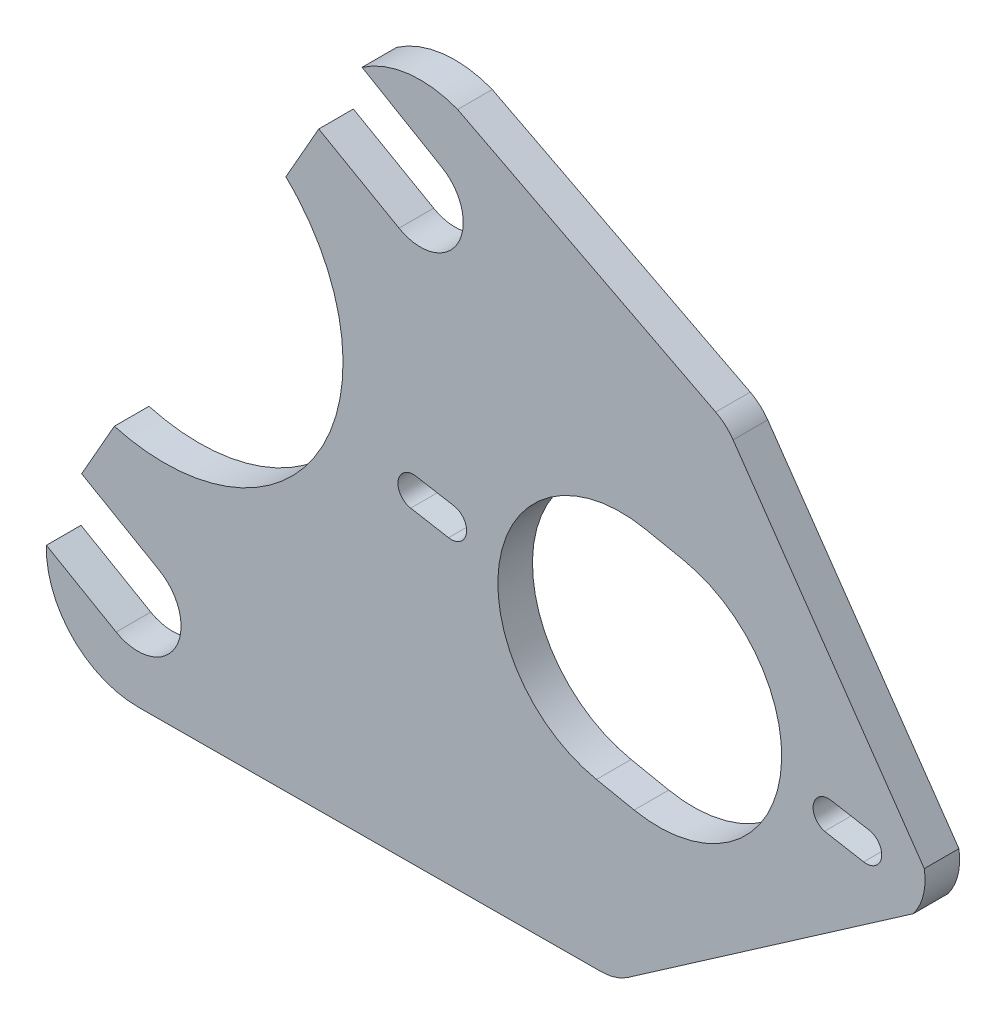
ISO-10303-21;
HEADER;
FILE_DESCRIPTION(('STEP AP214'),'2;1');
FILE_NAME('part.step','',(''),(''),'','','');
FILE_SCHEMA(('AUTOMOTIVE_DESIGN { 1 0 10303 214 1 1 1 1 }'));
ENDSEC;
DATA;
#1=APPLICATION_CONTEXT('core data for automotive mechanical design processes');
#2=APPLICATION_PROTOCOL_DEFINITION('international standard','automotive_design',2000,#1);
#3=PRODUCT_CONTEXT('',#1,'mechanical');
#4=PRODUCT('Part','Part','',(#3));
#5=PRODUCT_RELATED_PRODUCT_CATEGORY('part','',(#4));
#6=PRODUCT_DEFINITION_FORMATION('','',#4);
#7=PRODUCT_DEFINITION_CONTEXT('part definition',#1,'design');
#8=PRODUCT_DEFINITION('design','',#6,#7);
#9=PRODUCT_DEFINITION_SHAPE('','',#8);
#10=(LENGTH_UNIT() NAMED_UNIT(*) SI_UNIT(.MILLI.,.METRE.));
#11=(NAMED_UNIT(*) PLANE_ANGLE_UNIT() SI_UNIT($,.RADIAN.));
#12=(NAMED_UNIT(*) SI_UNIT($,.STERADIAN.) SOLID_ANGLE_UNIT());
#13=UNCERTAINTY_MEASURE_WITH_UNIT(LENGTH_MEASURE(1.E-05),#10,'distance_accuracy_value','');
#14=(GEOMETRIC_REPRESENTATION_CONTEXT(3) GLOBAL_UNCERTAINTY_ASSIGNED_CONTEXT((#13)) GLOBAL_UNIT_ASSIGNED_CONTEXT((#10,
#11,#12)) REPRESENTATION_CONTEXT('',''));
#15=CARTESIAN_POINT('',(0.,0.,0.));
#16=DIRECTION('',(0.,0.,1.));
#17=DIRECTION('',(1.,0.,0.));
#18=AXIS2_PLACEMENT_3D('',#15,#16,#17);
#19=CARTESIAN_POINT('',(62.0385147546457,77.7176448762416,3.6));
#20=DIRECTION('',(0.,0.,1.));
#21=DIRECTION('',(1.,0.,0.));
#22=AXIS2_PLACEMENT_3D('',#19,#20,#21);
#23=PLANE('',#22);
#24=CARTESIAN_POINT('',(88.3938452046275,69.2605225420493,3.6));
#25=DIRECTION('',(0.,0.,1.));
#26=DIRECTION('',(1.,0.,0.));
#27=AXIS2_PLACEMENT_3D('',#24,#25,#26);
#28=CIRCLE('',#27,1.59999999999999);
#29=CARTESIAN_POINT('',(88.6716822936606,70.8362149460285,3.6));
#30=VERTEX_POINT('',#29);
#31=CARTESIAN_POINT('',(88.1160081155944,67.6848301380701,3.6));
#32=VERTEX_POINT('',#31);
#33=EDGE_CURVE('E451',#30,#32,#28,.T.);
#34=ORIENTED_EDGE('',*,*,#33,.F.);
#35=DIRECTION('',(-0.984807752486969,0.173648180645712,0.));
#36=VECTOR('',#35,1.);
#37=CARTESIAN_POINT('',(14.7874848721337,83.8639926298628,3.6));
#38=LINE('',#37,#36);
#39=CARTESIAN_POINT('',(92.6109133036085,70.1416222234456,3.6));
#40=VERTEX_POINT('',#39);
#41=EDGE_CURVE('E449',#40,#30,#38,.T.);
#42=ORIENTED_EDGE('',*,*,#41,.F.);
#43=CARTESIAN_POINT('',(92.3330762145753,68.5659298194664,3.6));
#44=DIRECTION('',(0.,0.,1.));
#45=DIRECTION('',(1.,0.,0.));
#46=AXIS2_PLACEMENT_3D('',#43,#44,#45);
#47=CIRCLE('',#46,1.60000000000001);
#48=CARTESIAN_POINT('',(92.0552391255422,66.9902374154873,3.6));
#49=VERTEX_POINT('',#48);
#50=EDGE_CURVE('E457',#49,#40,#47,.T.);
#51=ORIENTED_EDGE('',*,*,#50,.F.);
#52=DIRECTION('',(-0.98480775248697,0.173648180645706,0.));
#53=VECTOR('',#52,1.);
#54=CARTESIAN_POINT('',(14.2318106940669,80.7126078219041,3.6));
#55=LINE('',#54,#53);
#56=EDGE_CURVE('E454',#49,#32,#55,.T.);
#57=ORIENTED_EDGE('',*,*,#56,.T.);
#58=EDGE_LOOP('',(#34,#42,#51,#57));
#59=FACE_BOUND('',#58,.T.);
#60=DIRECTION('',(-0.98457738784415,0.174949613734897,0.));
#61=VECTOR('',#60,1.);
#62=CARTESIAN_POINT('',(14.3668853296237,80.8536248084082,3.6));
#63=LINE('',#62,#61);
#64=CARTESIAN_POINT('',(135.228884267393,59.377649135547,3.6));
#65=VERTEX_POINT('',#64);
#66=CARTESIAN_POINT('',(131.161569827429,60.1003704766984,3.6));
#67=VERTEX_POINT('',#66);
#68=EDGE_CURVE('E480',#65,#67,#63,.T.);
#69=ORIENTED_EDGE('',*,*,#68,.T.);
#70=CARTESIAN_POINT('',(131.569557431556,61.6474794304822,3.6));
#71=DIRECTION('',(0.,0.,1.));
#72=DIRECTION('',(1.,0.,0.));
#73=AXIS2_PLACEMENT_3D('',#70,#71,#72);
#74=CIRCLE('',#73,1.6);
#75=CARTESIAN_POINT('',(131.847360571655,63.2231778201976,3.6));
#76=VERTEX_POINT('',#75);
#77=EDGE_CURVE('E489',#76,#67,#74,.T.);
#78=ORIENTED_EDGE('',*,*,#77,.F.);
#79=DIRECTION('',(-0.98481149357211,0.173626962561322,0.));
#80=VECTOR('',#79,1.);
#81=CARTESIAN_POINT('',(14.7852333251543,83.86178908483,3.6));
#82=LINE('',#81,#80);
#83=CARTESIAN_POINT('',(135.786606545943,62.5286699699523,3.6));
#84=VERTEX_POINT('',#83);
#85=EDGE_CURVE('E486',#84,#76,#82,.T.);
#86=ORIENTED_EDGE('',*,*,#85,.F.);
#87=CARTESIAN_POINT('',(135.508803527145,60.952972268249,3.6));
#88=DIRECTION('',(0.,0.,1.));
#89=DIRECTION('',(1.,0.,0.));
#90=AXIS2_PLACEMENT_3D('',#87,#88,#89);
#91=CIRCLE('',#90,1.59999930137684);
#92=EDGE_CURVE('E483',#65,#84,#91,.T.);
#93=ORIENTED_EDGE('',*,*,#92,.F.);
#94=EDGE_LOOP('',(#69,#78,#86,#93));
#95=FACE_BOUND('',#94,.T.);
#96=CARTESIAN_POINT('',(109.981701342205,65.4540011230173,3.6));
#97=DIRECTION('',(0.,0.,1.));
#98=DIRECTION('',(1.,0.,0.));
#99=AXIS2_PLACEMENT_3D('',#96,#97,#98);
#100=CIRCLE('',#99,12.8);
#101=CARTESIAN_POINT('',(112.523140625589,77.9991629939887,3.6));
#102=VERTEX_POINT('',#101);
#103=CARTESIAN_POINT('',(107.440262058821,52.908839252046,3.6));
#104=VERTEX_POINT('',#103);
#105=EDGE_CURVE('E512',#102,#104,#100,.T.);
#106=ORIENTED_EDGE('',*,*,#105,.F.);
#107=DIRECTION('',(-0.980090771169636,0.198549944014369,0.));
#108=VECTOR('',#107,1.);
#109=CARTESIAN_POINT('',(19.6142968870189,96.8209356964479,3.6));
#110=LINE('',#109,#108);
#111=CARTESIAN_POINT('',(116.443503710267,77.2049632179312,3.6));
#112=VERTEX_POINT('',#111);
#113=EDGE_CURVE('E510',#112,#102,#110,.T.);
#114=ORIENTED_EDGE('',*,*,#113,.F.);
#115=CARTESIAN_POINT('',(113.902064426883,64.6598013469599,3.6));
#116=DIRECTION('',(0.,0.,1.));
#117=DIRECTION('',(1.,0.,0.));
#118=AXIS2_PLACEMENT_3D('',#115,#116,#117);
#119=CIRCLE('',#118,12.8);
#120=CARTESIAN_POINT('',(111.3606251435,52.1146394759885,3.6));
#121=VERTEX_POINT('',#120);
#122=EDGE_CURVE('E518',#121,#112,#119,.T.);
#123=ORIENTED_EDGE('',*,*,#122,.F.);
#124=DIRECTION('',(-0.980090771169636,0.198549944014369,0.));
#125=VECTOR('',#124,1.);
#126=CARTESIAN_POINT('',(14.5314183202511,71.7306119545052,3.6));
#127=LINE('',#126,#125);
#128=EDGE_CURVE('E515',#121,#104,#127,.T.);
#129=ORIENTED_EDGE('',*,*,#128,.T.);
#130=EDGE_LOOP('',(#106,#114,#123,#129));
#131=FACE_BOUND('',#130,.T.);
#132=DIRECTION('',(-0.821795837048083,-0.569782065539484,0.));
#133=VECTOR('',#132,1.);
#134=CARTESIAN_POINT('',(97.0414458836371,27.2329686710503,3.6));
#135=LINE('',#134,#133);
#136=CARTESIAN_POINT('',(140.392023866923,57.2895602867628,3.6));
#137=VERTEX_POINT('',#136);
#138=CARTESIAN_POINT('',(110.735316218971,36.7274457335327,3.6));
#139=VERTEX_POINT('',#138);
#140=EDGE_CURVE('E440',#137,#139,#135,.T.);
#141=ORIENTED_EDGE('',*,*,#140,.F.);
#142=CARTESIAN_POINT('',(135.508803527145,60.952972268249,3.6));
#143=DIRECTION('',(0.,0.,1.));
#144=DIRECTION('',(1.,0.,0.));
#145=AXIS2_PLACEMENT_3D('',#142,#143,#144);
#146=CIRCLE('',#145,6.10462351279076);
#147=CARTESIAN_POINT('',(141.535727347608,61.9238571714403,3.6));
#148=VERTEX_POINT('',#147);
#149=EDGE_CURVE('E422',#137,#148,#146,.T.);
#150=ORIENTED_EDGE('',*,*,#149,.T.);
#151=DIRECTION('',(0.569782065539484,-0.821795837048083,0.));
#152=VECTOR('',#151,1.);
#153=CARTESIAN_POINT('',(124.581434059325,86.3770095029575,3.6));
#154=LINE('',#153,#152);
#155=CARTESIAN_POINT('',(121.651882961464,90.6022967526749,3.6));
#156=VERTEX_POINT('',#155);
#157=EDGE_CURVE('E426',#156,#148,#154,.T.);
#158=ORIENTED_EDGE('',*,*,#157,.F.);
#159=CARTESIAN_POINT('',(117.542903776224,87.7533864249775,3.6));
#160=DIRECTION('',(0.,0.,1.));
#161=DIRECTION('',(1.,0.,0.));
#162=AXIS2_PLACEMENT_3D('',#159,#160,#161);
#163=CIRCLE('',#162,5.);
#164=CARTESIAN_POINT('',(119.834613545866,92.1972660736322,3.6));
#165=VERTEX_POINT('',#164);
#166=EDGE_CURVE('E711',#156,#165,#163,.T.);
#167=ORIENTED_EDGE('',*,*,#166,.T.);
#168=DIRECTION('',(-0.888775929730931,0.458341953928417,0.));
#169=VECTOR('',#168,1.);
#170=CARTESIAN_POINT('',(62.7323198720739,121.64493221842,3.6));
#171=LINE('',#170,#169);
#172=CARTESIAN_POINT('',(92.9994998125568,106.0361404749,3.6));
#173=VERTEX_POINT('',#172);
#174=EDGE_CURVE('E447',#165,#173,#171,.T.);
#175=ORIENTED_EDGE('',*,*,#174,.T.);
#176=CARTESIAN_POINT('',(89.1295998537948,96.1540237001324,3.6));
#177=DIRECTION('',(0.,0.,1.));
#178=DIRECTION('',(1.,0.,0.));
#179=AXIS2_PLACEMENT_3D('',#176,#177,#178);
#180=CIRCLE('',#179,10.6128392827256);
#181=CARTESIAN_POINT('',(83.0608323656568,104.8604821544,3.6));
#182=VERTEX_POINT('',#181);
#183=EDGE_CURVE('E696',#173,#182,#180,.T.);
#184=ORIENTED_EDGE('',*,*,#183,.T.);
#185=DIRECTION('',(0.863225442370652,-0.504818616578263,0.));
#186=VECTOR('',#185,1.);
#187=CARTESIAN_POINT('',(83.0608323656568,104.8604821544,3.6));
#188=LINE('',#187,#186);
#189=CARTESIAN_POINT('',(91.3561306915568,100.0093496235,3.6));
#190=VERTEX_POINT('',#189);
#191=EDGE_CURVE('E723',#182,#190,#188,.T.);
#192=ORIENTED_EDGE('',*,*,#191,.T.);
#193=CARTESIAN_POINT('',(89.1300439095068,96.1537673169998,3.6));
#194=DIRECTION('',(0.,0.,1.));
#195=DIRECTION('',(1.,0.,0.));
#196=AXIS2_PLACEMENT_3D('',#193,#194,#195);
#197=CIRCLE('',#196,4.45207561519496);
#198=CARTESIAN_POINT('',(86.9039571274568,92.2981850104998,3.6));
#199=VERTEX_POINT('',#198);
#200=EDGE_CURVE('E725',#199,#190,#197,.T.);
#201=ORIENTED_EDGE('',*,*,#200,.F.);
#202=DIRECTION('',(0.868810396856309,-0.495144922537214,0.));
#203=VECTOR('',#202,1.);
#204=CARTESIAN_POINT('',(78.5551802845568,97.0562478491998,3.6));
#205=LINE('',#204,#203);
#206=CARTESIAN_POINT('',(78.5551802845568,97.0562478491998,3.6));
#207=VERTEX_POINT('',#206);
#208=EDGE_CURVE('E748',#207,#199,#205,.T.);
#209=ORIENTED_EDGE('',*,*,#208,.F.);
#210=DIRECTION('',(0.494117617130238,0.869395065802386,0.));
#211=VECTOR('',#210,1.);
#212=CARTESIAN_POINT('',(75.1349810422863,91.0384410716137,3.6));
#213=LINE('',#212,#211);
#214=CARTESIAN_POINT('',(75.1349810422863,91.0384410716137,3.6));
#215=VERTEX_POINT('',#214);
#216=EDGE_CURVE('E564',#215,#207,#213,.T.);
#217=ORIENTED_EDGE('',*,*,#216,.F.);
#218=CARTESIAN_POINT('',(62.0385147546457,77.7176448762416,3.6));
#219=DIRECTION('',(0.,0.,1.));
#220=DIRECTION('',(0.869395065803295,-0.494117617128639,0.));
#221=AXIS2_PLACEMENT_3D('',#218,#219,#220);
#222=ELLIPSE('',#221,19.1691381710503,18.6472955858899);
#223=CARTESIAN_POINT('',(57.2951320903117,59.6494030856947,3.6));
#224=VERTEX_POINT('',#223);
#225=EDGE_CURVE('E560',#224,#215,#222,.T.);
#226=ORIENTED_EDGE('',*,*,#225,.F.);
#227=DIRECTION('',(0.494117617130272,0.869395065802367,0.));
#228=VECTOR('',#227,1.);
#229=CARTESIAN_POINT('',(53.8970007932,53.6704246396,3.6));
#230=LINE('',#229,#228);
#231=CARTESIAN_POINT('',(53.8970007932,53.6704246396,3.6));
#232=VERTEX_POINT('',#231);
#233=EDGE_CURVE('E557',#232,#224,#230,.T.);
#234=ORIENTED_EDGE('',*,*,#233,.F.);
#235=DIRECTION('',(-0.865993027095381,0.500056073877899,0.));
#236=VECTOR('',#235,1.);
#237=CARTESIAN_POINT('',(61.9848103957,49.0002273175,3.6));
#238=LINE('',#237,#236);
#239=CARTESIAN_POINT('',(61.9848103957,49.0002273175,3.6));
#240=VERTEX_POINT('',#239);
#241=EDGE_CURVE('E554',#240,#232,#238,.T.);
#242=ORIENTED_EDGE('',*,*,#241,.F.);
#243=CARTESIAN_POINT('',(59.73290559445,45.10432597855,3.6));
#244=DIRECTION('',(0.,0.,1.));
#245=DIRECTION('',(1.,0.,0.));
#246=AXIS2_PLACEMENT_3D('',#243,#244,#245);
#247=CIRCLE('',#246,4.49990249635758);
#248=CARTESIAN_POINT('',(57.4810007932,41.2084246396,3.6));
#249=VERTEX_POINT('',#248);
#250=EDGE_CURVE('E551',#249,#240,#247,.T.);
#251=ORIENTED_EDGE('',*,*,#250,.F.);
#252=DIRECTION('',(0.866028909405279,-0.499993928037435,0.));
#253=VECTOR('',#252,1.);
#254=CARTESIAN_POINT('',(50.2285358717,45.3955694158,3.6));
#255=LINE('',#254,#253);
#256=CARTESIAN_POINT('',(50.2285358717,45.3955694158,3.6));
#257=VERTEX_POINT('',#256);
#258=EDGE_CURVE('E548',#257,#249,#255,.T.);
#259=ORIENTED_EDGE('',*,*,#258,.F.);
#260=CARTESIAN_POINT('',(59.7347823866165,45.103647176955,3.6));
#261=DIRECTION('',(0.,0.,1.));
#262=DIRECTION('',(1.,0.,0.));
#263=AXIS2_PLACEMENT_3D('',#260,#261,#262);
#264=CIRCLE('',#263,9.51072770064907);
#265=CARTESIAN_POINT('',(59.7828894487,35.5930411444,3.6));
#266=VERTEX_POINT('',#265);
#267=EDGE_CURVE('E544',#257,#266,#264,.T.);
#268=ORIENTED_EDGE('',*,*,#267,.T.);
#269=DIRECTION('',(0.999987207278143,0.00505818940525294,0.));
#270=VECTOR('',#269,1.);
#271=CARTESIAN_POINT('',(107.879099237603,35.8363239954365,3.6));
#272=LINE('',#271,#270);
#273=CARTESIAN_POINT('',(107.9116968383,35.8364888823843,3.6));
#274=VERTEX_POINT('',#273);
#275=EDGE_CURVE('E541',#266,#274,#272,.T.);
#276=ORIENTED_EDGE('',*,*,#275,.T.);
#277=CARTESIAN_POINT('',(107.886405891274,40.8364249187731,3.6));
#278=DIRECTION('',(0.,0.,1.));
#279=DIRECTION('',(1.,0.,0.));
#280=AXIS2_PLACEMENT_3D('',#277,#278,#279);
#281=CIRCLE('',#280,5.);
#282=EDGE_CURVE('E761',#274,#139,#281,.T.);
#283=ORIENTED_EDGE('',*,*,#282,.T.);
#284=EDGE_LOOP('',(#141,#150,#158,#167,#175,#184,#192,#201,#209,#217,#226,#234,#242,#251,#259,
#268,#276,#283));
#285=FACE_BOUND('',#284,.T.);
#286=ADVANCED_FACE('F224',(#59,#95,#131,#285),#23,.T.);
#287=CARTESIAN_POINT('',(62.0385147546457,77.7176448762416,0.));
#288=DIRECTION('',(0.,0.,1.));
#289=DIRECTION('',(1.,0.,0.));
#290=AXIS2_PLACEMENT_3D('',#287,#288,#289);
#291=PLANE('',#290);
#292=DIRECTION('',(-0.984807752486969,0.173648180645712,0.));
#293=VECTOR('',#292,1.);
#294=CARTESIAN_POINT('',(14.7874848721337,83.8639926298628,0.));
#295=LINE('',#294,#293);
#296=CARTESIAN_POINT('',(92.6109133036085,70.1416222234456,0.));
#297=VERTEX_POINT('',#296);
#298=CARTESIAN_POINT('',(88.6716822936606,70.8362149460285,0.));
#299=VERTEX_POINT('',#298);
#300=EDGE_CURVE('E443',#297,#299,#295,.T.);
#301=ORIENTED_EDGE('',*,*,#300,.T.);
#302=CARTESIAN_POINT('',(88.3938452046275,69.2605225420493,0.));
#303=DIRECTION('',(0.,0.,1.));
#304=DIRECTION('',(1.,0.,0.));
#305=AXIS2_PLACEMENT_3D('',#302,#303,#304);
#306=CIRCLE('',#305,1.59999999999999);
#307=CARTESIAN_POINT('',(88.1160081155944,67.6848301380701,0.));
#308=VERTEX_POINT('',#307);
#309=EDGE_CURVE('E462',#299,#308,#306,.T.);
#310=ORIENTED_EDGE('',*,*,#309,.T.);
#311=DIRECTION('',(-0.98480775248697,0.173648180645706,0.));
#312=VECTOR('',#311,1.);
#313=CARTESIAN_POINT('',(14.2318106940669,80.7126078219041,0.));
#314=LINE('',#313,#312);
#315=CARTESIAN_POINT('',(92.0552391255422,66.9902374154873,0.));
#316=VERTEX_POINT('',#315);
#317=EDGE_CURVE('E465',#316,#308,#314,.T.);
#318=ORIENTED_EDGE('',*,*,#317,.F.);
#319=CARTESIAN_POINT('',(92.3330762145753,68.5659298194664,0.));
#320=DIRECTION('',(0.,0.,1.));
#321=DIRECTION('',(1.,0.,0.));
#322=AXIS2_PLACEMENT_3D('',#319,#320,#321);
#323=CIRCLE('',#322,1.60000000000001);
#324=EDGE_CURVE('E452',#316,#297,#323,.T.);
#325=ORIENTED_EDGE('',*,*,#324,.T.);
#326=EDGE_LOOP('',(#301,#310,#318,#325));
#327=FACE_BOUND('',#326,.T.);
#328=CARTESIAN_POINT('',(131.569557431556,61.6474794304822,0.));
#329=DIRECTION('',(0.,0.,1.));
#330=DIRECTION('',(1.,0.,0.));
#331=AXIS2_PLACEMENT_3D('',#328,#329,#330);
#332=CIRCLE('',#331,1.6);
#333=CARTESIAN_POINT('',(131.847360571655,63.2231778201976,0.));
#334=VERTEX_POINT('',#333);
#335=CARTESIAN_POINT('',(131.161569827429,60.1003704766984,0.));
#336=VERTEX_POINT('',#335);
#337=EDGE_CURVE('E484',#334,#336,#332,.T.);
#338=ORIENTED_EDGE('',*,*,#337,.T.);
#339=DIRECTION('',(-0.98457738784415,0.174949613734897,0.));
#340=VECTOR('',#339,1.);
#341=CARTESIAN_POINT('',(14.3668853296237,80.8536248084082,0.));
#342=LINE('',#341,#340);
#343=CARTESIAN_POINT('',(135.228884267393,59.377649135547,0.));
#344=VERTEX_POINT('',#343);
#345=EDGE_CURVE('E479',#344,#336,#342,.T.);
#346=ORIENTED_EDGE('',*,*,#345,.F.);
#347=CARTESIAN_POINT('',(135.508803527145,60.952972268249,0.));
#348=DIRECTION('',(0.,0.,1.));
#349=DIRECTION('',(1.,0.,0.));
#350=AXIS2_PLACEMENT_3D('',#347,#348,#349);
#351=CIRCLE('',#350,1.59999930137684);
#352=CARTESIAN_POINT('',(135.786606545943,62.5286699699523,0.));
#353=VERTEX_POINT('',#352);
#354=EDGE_CURVE('E493',#344,#353,#351,.T.);
#355=ORIENTED_EDGE('',*,*,#354,.T.);
#356=DIRECTION('',(-0.98481149357211,0.173626962561322,0.));
#357=VECTOR('',#356,1.);
#358=CARTESIAN_POINT('',(14.7852333251543,83.86178908483,0.));
#359=LINE('',#358,#357);
#360=EDGE_CURVE('E496',#353,#334,#359,.T.);
#361=ORIENTED_EDGE('',*,*,#360,.T.);
#362=EDGE_LOOP('',(#338,#346,#355,#361));
#363=FACE_BOUND('',#362,.T.);
#364=DIRECTION('',(-0.980090771169636,0.198549944014369,0.));
#365=VECTOR('',#364,1.);
#366=CARTESIAN_POINT('',(19.6142968870189,96.8209356964479,0.));
#367=LINE('',#366,#365);
#368=CARTESIAN_POINT('',(116.443503710267,77.2049632179312,0.));
#369=VERTEX_POINT('',#368);
#370=CARTESIAN_POINT('',(112.523140625589,77.9991629939887,0.));
#371=VERTEX_POINT('',#370);
#372=EDGE_CURVE('E509',#369,#371,#367,.T.);
#373=ORIENTED_EDGE('',*,*,#372,.T.);
#374=CARTESIAN_POINT('',(109.981701342205,65.4540011230173,0.));
#375=DIRECTION('',(0.,0.,1.));
#376=DIRECTION('',(1.,0.,0.));
#377=AXIS2_PLACEMENT_3D('',#374,#375,#376);
#378=CIRCLE('',#377,12.8);
#379=CARTESIAN_POINT('',(107.440262058821,52.908839252046,0.));
#380=VERTEX_POINT('',#379);
#381=EDGE_CURVE('E523',#371,#380,#378,.T.);
#382=ORIENTED_EDGE('',*,*,#381,.T.);
#383=DIRECTION('',(-0.980090771169636,0.198549944014369,0.));
#384=VECTOR('',#383,1.);
#385=CARTESIAN_POINT('',(14.5314183202511,71.7306119545052,0.));
#386=LINE('',#385,#384);
#387=CARTESIAN_POINT('',(111.3606251435,52.1146394759885,0.));
#388=VERTEX_POINT('',#387);
#389=EDGE_CURVE('E526',#388,#380,#386,.T.);
#390=ORIENTED_EDGE('',*,*,#389,.F.);
#391=CARTESIAN_POINT('',(113.902064426883,64.6598013469599,0.));
#392=DIRECTION('',(0.,0.,1.));
#393=DIRECTION('',(1.,0.,0.));
#394=AXIS2_PLACEMENT_3D('',#391,#392,#393);
#395=CIRCLE('',#394,12.8);
#396=EDGE_CURVE('E513',#388,#369,#395,.T.);
#397=ORIENTED_EDGE('',*,*,#396,.T.);
#398=EDGE_LOOP('',(#373,#382,#390,#397));
#399=FACE_BOUND('',#398,.T.);
#400=CARTESIAN_POINT('',(135.508803527145,60.952972268249,0.));
#401=DIRECTION('',(0.,0.,-1.));
#402=DIRECTION('',(-1.,0.,0.));
#403=AXIS2_PLACEMENT_3D('',#400,#401,#402);
#404=CIRCLE('',#403,6.10462351279076);
#405=CARTESIAN_POINT('',(141.535727347608,61.9238571714403,0.));
#406=VERTEX_POINT('',#405);
#407=CARTESIAN_POINT('',(140.392023866923,57.2895602867629,0.));
#408=VERTEX_POINT('',#407);
#409=EDGE_CURVE('E238',#406,#408,#404,.T.);
#410=ORIENTED_EDGE('',*,*,#409,.T.);
#411=DIRECTION('',(0.821795837048083,0.569782065539484,0.));
#412=VECTOR('',#411,1.);
#413=CARTESIAN_POINT('',(140.869018833265,57.6202788970579,0.));
#414=LINE('',#413,#412);
#415=CARTESIAN_POINT('',(110.735316218971,36.7274457335327,0.));
#416=VERTEX_POINT('',#415);
#417=EDGE_CURVE('E432',#416,#408,#414,.T.);
#418=ORIENTED_EDGE('',*,*,#417,.F.);
#419=CARTESIAN_POINT('',(107.886405891274,40.8364249187731,0.));
#420=DIRECTION('',(0.,0.,1.));
#421=DIRECTION('',(1.,0.,0.));
#422=AXIS2_PLACEMENT_3D('',#419,#420,#421);
#423=CIRCLE('',#422,5.);
#424=CARTESIAN_POINT('',(107.9116968383,35.8364888823824,0.));
#425=VERTEX_POINT('',#424);
#426=EDGE_CURVE('E705',#416,#425,#423,.F.);
#427=ORIENTED_EDGE('',*,*,#426,.T.);
#428=DIRECTION('',(0.999987207278144,0.00505818940520393,0.));
#429=VECTOR('',#428,1.);
#430=CARTESIAN_POINT('',(59.7828894487,35.5930411444,0.));
#431=LINE('',#430,#429);
#432=CARTESIAN_POINT('',(59.7828894487,35.5930411444,0.));
#433=VERTEX_POINT('',#432);
#434=EDGE_CURVE('E540',#433,#425,#431,.T.);
#435=ORIENTED_EDGE('',*,*,#434,.F.);
#436=CARTESIAN_POINT('',(59.7347823866165,45.103647176955,0.));
#437=DIRECTION('',(0.,0.,1.));
#438=DIRECTION('',(1.,0.,0.));
#439=AXIS2_PLACEMENT_3D('',#436,#437,#438);
#440=CIRCLE('',#439,9.51072770064907);
#441=CARTESIAN_POINT('',(50.2285358717,45.3955694158,0.));
#442=VERTEX_POINT('',#441);
#443=EDGE_CURVE('E731',#442,#433,#440,.T.);
#444=ORIENTED_EDGE('',*,*,#443,.F.);
#445=DIRECTION('',(0.866028909405279,-0.499993928037435,0.));
#446=VECTOR('',#445,1.);
#447=CARTESIAN_POINT('',(50.2285358717,45.3955694158,0.));
#448=LINE('',#447,#446);
#449=CARTESIAN_POINT('',(57.4810007932,41.2084246396,0.));
#450=VERTEX_POINT('',#449);
#451=EDGE_CURVE('E733',#442,#450,#448,.T.);
#452=ORIENTED_EDGE('',*,*,#451,.T.);
#453=CARTESIAN_POINT('',(59.73290559445,45.10432597855,0.));
#454=DIRECTION('',(0.,0.,1.));
#455=DIRECTION('',(1.,0.,0.));
#456=AXIS2_PLACEMENT_3D('',#453,#454,#455);
#457=CIRCLE('',#456,4.49990249635758);
#458=CARTESIAN_POINT('',(61.9848103957,49.0002273175,0.));
#459=VERTEX_POINT('',#458);
#460=EDGE_CURVE('E736',#450,#459,#457,.T.);
#461=ORIENTED_EDGE('',*,*,#460,.T.);
#462=DIRECTION('',(-0.865993027095381,0.500056073877899,0.));
#463=VECTOR('',#462,1.);
#464=CARTESIAN_POINT('',(61.9848103957,49.0002273175,0.));
#465=LINE('',#464,#463);
#466=CARTESIAN_POINT('',(53.8970007932,53.6704246396,0.));
#467=VERTEX_POINT('',#466);
#468=EDGE_CURVE('E739',#459,#467,#465,.T.);
#469=ORIENTED_EDGE('',*,*,#468,.T.);
#470=DIRECTION('',(0.494117617130272,0.869395065802367,0.));
#471=VECTOR('',#470,1.);
#472=CARTESIAN_POINT('',(53.8970007932,53.6704246396,0.));
#473=LINE('',#472,#471);
#474=CARTESIAN_POINT('',(57.2951320903117,59.6494030856947,0.));
#475=VERTEX_POINT('',#474);
#476=EDGE_CURVE('E661',#467,#475,#473,.T.);
#477=ORIENTED_EDGE('',*,*,#476,.T.);
#478=CARTESIAN_POINT('',(62.0385147546457,77.7176448762416,0.));
#479=DIRECTION('',(0.,0.,1.));
#480=DIRECTION('',(0.869395065803295,-0.494117617128639,0.));
#481=AXIS2_PLACEMENT_3D('',#478,#479,#480);
#482=ELLIPSE('',#481,19.1691381710503,18.6472955858899);
#483=CARTESIAN_POINT('',(75.1349810422863,91.0384410716137,0.));
#484=VERTEX_POINT('',#483);
#485=EDGE_CURVE('E659',#475,#484,#482,.T.);
#486=ORIENTED_EDGE('',*,*,#485,.T.);
#487=DIRECTION('',(0.494117617130238,0.869395065802386,0.));
#488=VECTOR('',#487,1.);
#489=CARTESIAN_POINT('',(75.1349810422863,91.0384410716137,0.));
#490=LINE('',#489,#488);
#491=CARTESIAN_POINT('',(78.5551802845568,97.0562478491998,0.));
#492=VERTEX_POINT('',#491);
#493=EDGE_CURVE('E653',#484,#492,#490,.T.);
#494=ORIENTED_EDGE('',*,*,#493,.T.);
#495=DIRECTION('',(0.868810396856309,-0.495144922537214,0.));
#496=VECTOR('',#495,1.);
#497=CARTESIAN_POINT('',(78.5551802845568,97.0562478491998,0.));
#498=LINE('',#497,#496);
#499=CARTESIAN_POINT('',(86.9039571274568,92.2981850104998,0.));
#500=VERTEX_POINT('',#499);
#501=EDGE_CURVE('E644',#492,#500,#498,.T.);
#502=ORIENTED_EDGE('',*,*,#501,.T.);
#503=CARTESIAN_POINT('',(89.1300439095068,96.1537673169998,0.));
#504=DIRECTION('',(0.,0.,1.));
#505=DIRECTION('',(1.,0.,0.));
#506=AXIS2_PLACEMENT_3D('',#503,#504,#505);
#507=CIRCLE('',#506,4.45207561519496);
#508=CARTESIAN_POINT('',(91.3561306915568,100.0093496235,0.));
#509=VERTEX_POINT('',#508);
#510=EDGE_CURVE('E652',#500,#509,#507,.T.);
#511=ORIENTED_EDGE('',*,*,#510,.T.);
#512=DIRECTION('',(0.863225442370652,-0.504818616578263,0.));
#513=VECTOR('',#512,1.);
#514=CARTESIAN_POINT('',(83.0608323656568,104.8604821544,0.));
#515=LINE('',#514,#513);
#516=CARTESIAN_POINT('',(83.0608323656568,104.8604821544,0.));
#517=VERTEX_POINT('',#516);
#518=EDGE_CURVE('E666',#517,#509,#515,.T.);
#519=ORIENTED_EDGE('',*,*,#518,.F.);
#520=CARTESIAN_POINT('',(89.1295998537948,96.1540237001324,0.));
#521=DIRECTION('',(0.,0.,1.));
#522=DIRECTION('',(1.,0.,0.));
#523=AXIS2_PLACEMENT_3D('',#520,#521,#522);
#524=CIRCLE('',#523,10.6128392827256);
#525=CARTESIAN_POINT('',(92.9994998125568,106.0361404749,0.));
#526=VERTEX_POINT('',#525);
#527=EDGE_CURVE('E545',#526,#517,#524,.T.);
#528=ORIENTED_EDGE('',*,*,#527,.F.);
#529=DIRECTION('',(-0.888775929730931,0.458341953928417,0.));
#530=VECTOR('',#529,1.);
#531=CARTESIAN_POINT('',(62.7323198720739,121.64493221842,0.));
#532=LINE('',#531,#530);
#533=CARTESIAN_POINT('',(119.834613545866,92.1972660736322,0.));
#534=VERTEX_POINT('',#533);
#535=EDGE_CURVE('E441',#534,#526,#532,.T.);
#536=ORIENTED_EDGE('',*,*,#535,.F.);
#537=CARTESIAN_POINT('',(117.542903776224,87.7533864249775,0.));
#538=DIRECTION('',(0.,0.,1.));
#539=DIRECTION('',(1.,0.,0.));
#540=AXIS2_PLACEMENT_3D('',#537,#538,#539);
#541=CIRCLE('',#540,5.);
#542=CARTESIAN_POINT('',(121.651882961464,90.6022967526749,0.));
#543=VERTEX_POINT('',#542);
#544=EDGE_CURVE('E232',#534,#543,#541,.F.);
#545=ORIENTED_EDGE('',*,*,#544,.T.);
#546=DIRECTION('',(0.569782065539484,-0.821795837048083,0.));
#547=VECTOR('',#546,1.);
#548=CARTESIAN_POINT('',(124.581434059325,86.3770095029575,0.));
#549=LINE('',#548,#547);
#550=EDGE_CURVE('E435',#543,#406,#549,.T.);
#551=ORIENTED_EDGE('',*,*,#550,.T.);
#552=EDGE_LOOP('',(#410,#418,#427,#435,#444,#452,#461,#469,#477,#486,#494,#502,#511,#519,#528,
#536,#545,#551));
#553=FACE_BOUND('',#552,.T.);
#554=ADVANCED_FACE('F431',(#327,#363,#399,#553),#291,.F.);
#555=CARTESIAN_POINT('',(140.869018833265,57.6202788970579,10.));
#556=DIRECTION('',(-0.569782065539484,0.821795837048083,0.));
#557=DIRECTION('',(-0.821795837048083,-0.569782065539484,0.));
#558=AXIS2_PLACEMENT_3D('',#555,#556,#557);
#559=PLANE('',#558);
#560=DIRECTION('',(0.,0.,-1.));
#561=VECTOR('',#560,1.);
#562=CARTESIAN_POINT('',(140.392023866923,57.2895602867629,10.));
#563=LINE('',#562,#561);
#564=EDGE_CURVE('E419',#137,#408,#563,.T.);
#565=ORIENTED_EDGE('',*,*,#564,.F.);
#566=ORIENTED_EDGE('',*,*,#140,.T.);
#567=DIRECTION('',(0.,0.,1.));
#568=VECTOR('',#567,1.);
#569=CARTESIAN_POINT('',(110.735316218971,36.7274457335327,10.));
#570=LINE('',#569,#568);
#571=EDGE_CURVE('E439',#139,#416,#570,.F.);
#572=ORIENTED_EDGE('',*,*,#571,.T.);
#573=ORIENTED_EDGE('',*,*,#417,.T.);
#574=EDGE_LOOP('',(#565,#566,#572,#573));
#575=FACE_BOUND('',#574,.T.);
#576=ADVANCED_FACE('F437',(#575),#559,.F.);
#577=CARTESIAN_POINT('',(124.581434059325,86.3770095029575,0.));
#578=DIRECTION('',(-0.821795837048083,-0.569782065539484,0.));
#579=DIRECTION('',(0.569782065539484,-0.821795837048083,0.));
#580=AXIS2_PLACEMENT_3D('',#577,#578,#579);
#581=PLANE('',#580);
#582=DIRECTION('',(0.,0.,-1.));
#583=VECTOR('',#582,1.);
#584=CARTESIAN_POINT('',(141.535727347608,61.9238571714403,10.));
#585=LINE('',#584,#583);
#586=EDGE_CURVE('E12',#406,#148,#585,.F.);
#587=ORIENTED_EDGE('',*,*,#586,.F.);
#588=ORIENTED_EDGE('',*,*,#550,.F.);
#589=DIRECTION('',(0.,0.,1.));
#590=VECTOR('',#589,1.);
#591=CARTESIAN_POINT('',(121.651882961464,90.6022967526749,3.6));
#592=LINE('',#591,#590);
#593=EDGE_CURVE('E708',#543,#156,#592,.T.);
#594=ORIENTED_EDGE('',*,*,#593,.T.);
#595=ORIENTED_EDGE('',*,*,#157,.T.);
#596=EDGE_LOOP('',(#587,#588,#594,#595));
#597=FACE_BOUND('',#596,.T.);
#598=ADVANCED_FACE('F627',(#597),#581,.F.);
#599=CARTESIAN_POINT('',(89.1295998537948,96.1540237001324,3.6));
#600=DIRECTION('',(0.,0.,-1.));
#601=DIRECTION('',(-1.,0.,0.));
#602=AXIS2_PLACEMENT_3D('',#599,#600,#601);
#603=CYLINDRICAL_SURFACE('',#602,10.6128392827256);
#604=ORIENTED_EDGE('',*,*,#527,.T.);
#605=DIRECTION('',(0.,0.,-1.));
#606=VECTOR('',#605,1.);
#607=CARTESIAN_POINT('',(83.0608323656568,104.8604821544,3.6));
#608=LINE('',#607,#606);
#609=EDGE_CURVE('E674',#182,#517,#608,.T.);
#610=ORIENTED_EDGE('',*,*,#609,.F.);
#611=ORIENTED_EDGE('',*,*,#183,.F.);
#612=DIRECTION('',(0.,0.,-1.));
#613=VECTOR('',#612,1.);
#614=CARTESIAN_POINT('',(92.9994998125568,106.0361404749,3.6));
#615=LINE('',#614,#613);
#616=EDGE_CURVE('E670',#173,#526,#615,.T.);
#617=ORIENTED_EDGE('',*,*,#616,.T.);
#618=EDGE_LOOP('',(#604,#610,#611,#617));
#619=FACE_BOUND('',#618,.T.);
#620=ADVANCED_FACE('F623',(#619),#603,.T.);
#621=CARTESIAN_POINT('',(83.0608323656568,104.8604821544,3.6));
#622=DIRECTION('',(0.504818616578263,0.863225442370652,0.));
#623=DIRECTION('',(-0.863225442370652,0.504818616578263,0.));
#624=AXIS2_PLACEMENT_3D('',#621,#622,#623);
#625=PLANE('',#624);
#626=ORIENTED_EDGE('',*,*,#518,.T.);
#627=DIRECTION('',(0.,0.,-1.));
#628=VECTOR('',#627,1.);
#629=CARTESIAN_POINT('',(91.3561306915568,100.0093496235,3.6));
#630=LINE('',#629,#628);
#631=EDGE_CURVE('E677',#190,#509,#630,.T.);
#632=ORIENTED_EDGE('',*,*,#631,.F.);
#633=ORIENTED_EDGE('',*,*,#191,.F.);
#634=ORIENTED_EDGE('',*,*,#609,.T.);
#635=EDGE_LOOP('',(#626,#632,#633,#634));
#636=FACE_BOUND('',#635,.T.);
#637=ADVANCED_FACE('F626',(#636),#625,.F.);
#638=CARTESIAN_POINT('',(89.1300439095068,96.1537673169998,3.6));
#639=DIRECTION('',(0.,0.,-1.));
#640=DIRECTION('',(-1.,0.,0.));
#641=AXIS2_PLACEMENT_3D('',#638,#639,#640);
#642=CYLINDRICAL_SURFACE('',#641,4.45207561519496);
#643=ORIENTED_EDGE('',*,*,#510,.F.);
#644=DIRECTION('',(0.,0.,-1.));
#645=VECTOR('',#644,1.);
#646=CARTESIAN_POINT('',(86.9039571274568,92.2981850104998,3.6));
#647=LINE('',#646,#645);
#648=EDGE_CURVE('E649',#199,#500,#647,.T.);
#649=ORIENTED_EDGE('',*,*,#648,.F.);
#650=ORIENTED_EDGE('',*,*,#200,.T.);
#651=ORIENTED_EDGE('',*,*,#631,.T.);
#652=EDGE_LOOP('',(#643,#649,#650,#651));
#653=FACE_BOUND('',#652,.T.);
#654=ADVANCED_FACE('F631',(#653),#642,.F.);
#655=CARTESIAN_POINT('',(78.5551802845568,97.0562478491998,3.6));
#656=DIRECTION('',(0.495144922537214,0.868810396856309,0.));
#657=DIRECTION('',(-0.868810396856309,0.495144922537214,0.));
#658=AXIS2_PLACEMENT_3D('',#655,#656,#657);
#659=PLANE('',#658);
#660=ORIENTED_EDGE('',*,*,#501,.F.);
#661=DIRECTION('',(0.,0.,-1.));
#662=VECTOR('',#661,1.);
#663=CARTESIAN_POINT('',(78.5551802845568,97.0562478491998,3.6));
#664=LINE('',#663,#662);
#665=EDGE_CURVE('E647',#207,#492,#664,.T.);
#666=ORIENTED_EDGE('',*,*,#665,.F.);
#667=ORIENTED_EDGE('',*,*,#208,.T.);
#668=ORIENTED_EDGE('',*,*,#648,.T.);
#669=EDGE_LOOP('',(#660,#666,#667,#668));
#670=FACE_BOUND('',#669,.T.);
#671=ADVANCED_FACE('F634',(#670),#659,.T.);
#672=CARTESIAN_POINT('',(75.1349810422863,91.0384410716137,3.6));
#673=DIRECTION('',(-0.869395065802386,0.494117617130238,0.));
#674=DIRECTION('',(-0.494117617130238,-0.869395065802386,0.));
#675=AXIS2_PLACEMENT_3D('',#672,#673,#674);
#676=PLANE('',#675);
#677=ORIENTED_EDGE('',*,*,#493,.F.);
#678=DIRECTION('',(0.,0.,-1.));
#679=VECTOR('',#678,1.);
#680=CARTESIAN_POINT('',(75.1349810422863,91.0384410716137,3.6));
#681=LINE('',#680,#679);
#682=EDGE_CURVE('E681',#215,#484,#681,.T.);
#683=ORIENTED_EDGE('',*,*,#682,.F.);
#684=ORIENTED_EDGE('',*,*,#216,.T.);
#685=ORIENTED_EDGE('',*,*,#665,.T.);
#686=EDGE_LOOP('',(#677,#683,#684,#685));
#687=FACE_BOUND('',#686,.T.);
#688=ADVANCED_FACE('F572',(#687),#676,.T.);
#689=DIRECTION('',(0.,0.,-1.));
#690=VECTOR('',#689,1.);
#691=SURFACE_OF_LINEAR_EXTRUSION('',#222,#690);
#692=ORIENTED_EDGE('',*,*,#485,.F.);
#693=DIRECTION('',(0.,0.,-1.));
#694=VECTOR('',#693,1.);
#695=CARTESIAN_POINT('',(57.2951320903117,59.6494030856947,3.6));
#696=LINE('',#695,#694);
#697=EDGE_CURVE('E683',#224,#475,#696,.T.);
#698=ORIENTED_EDGE('',*,*,#697,.F.);
#699=ORIENTED_EDGE('',*,*,#225,.T.);
#700=ORIENTED_EDGE('',*,*,#682,.T.);
#701=EDGE_LOOP('',(#692,#698,#699,#700));
#702=FACE_BOUND('',#701,.T.);
#703=ADVANCED_FACE('F567',(#702),#691,.T.);
#704=CARTESIAN_POINT('',(53.8970007932,53.6704246396,3.6));
#705=DIRECTION('',(-0.869395065802367,0.494117617130272,0.));
#706=DIRECTION('',(-0.494117617130272,-0.869395065802367,0.));
#707=AXIS2_PLACEMENT_3D('',#704,#705,#706);
#708=PLANE('',#707);
#709=ORIENTED_EDGE('',*,*,#476,.F.);
#710=DIRECTION('',(0.,0.,-1.));
#711=VECTOR('',#710,1.);
#712=CARTESIAN_POINT('',(53.8970007932,53.6704246396,3.6));
#713=LINE('',#712,#711);
#714=EDGE_CURVE('E685',#232,#467,#713,.T.);
#715=ORIENTED_EDGE('',*,*,#714,.F.);
#716=ORIENTED_EDGE('',*,*,#233,.T.);
#717=ORIENTED_EDGE('',*,*,#697,.T.);
#718=EDGE_LOOP('',(#709,#715,#716,#717));
#719=FACE_BOUND('',#718,.T.);
#720=ADVANCED_FACE('F571',(#719),#708,.T.);
#721=CARTESIAN_POINT('',(61.9848103957,49.0002273175,3.6));
#722=DIRECTION('',(-0.500056073877899,-0.865993027095381,0.));
#723=DIRECTION('',(0.865993027095381,-0.500056073877899,0.));
#724=AXIS2_PLACEMENT_3D('',#721,#722,#723);
#725=PLANE('',#724);
#726=ORIENTED_EDGE('',*,*,#468,.F.);
#727=DIRECTION('',(0.,0.,-1.));
#728=VECTOR('',#727,1.);
#729=CARTESIAN_POINT('',(61.9848103957,49.0002273175,3.6));
#730=LINE('',#729,#728);
#731=EDGE_CURVE('E687',#240,#459,#730,.T.);
#732=ORIENTED_EDGE('',*,*,#731,.F.);
#733=ORIENTED_EDGE('',*,*,#241,.T.);
#734=ORIENTED_EDGE('',*,*,#714,.T.);
#735=EDGE_LOOP('',(#726,#732,#733,#734));
#736=FACE_BOUND('',#735,.T.);
#737=ADVANCED_FACE('F577',(#736),#725,.T.);
#738=CARTESIAN_POINT('',(59.73290559445,45.10432597855,3.6));
#739=DIRECTION('',(0.,0.,-1.));
#740=DIRECTION('',(-1.,0.,0.));
#741=AXIS2_PLACEMENT_3D('',#738,#739,#740);
#742=CYLINDRICAL_SURFACE('',#741,4.49990249635758);
#743=ORIENTED_EDGE('',*,*,#460,.F.);
#744=DIRECTION('',(0.,0.,-1.));
#745=VECTOR('',#744,1.);
#746=CARTESIAN_POINT('',(57.4810007932,41.2084246396,3.6));
#747=LINE('',#746,#745);
#748=EDGE_CURVE('E689',#249,#450,#747,.T.);
#749=ORIENTED_EDGE('',*,*,#748,.F.);
#750=ORIENTED_EDGE('',*,*,#250,.T.);
#751=ORIENTED_EDGE('',*,*,#731,.T.);
#752=EDGE_LOOP('',(#743,#749,#750,#751));
#753=FACE_BOUND('',#752,.T.);
#754=ADVANCED_FACE('F581',(#753),#742,.F.);
#755=CARTESIAN_POINT('',(50.2285358717,45.3955694158,3.6));
#756=DIRECTION('',(0.499993928037435,0.866028909405279,0.));
#757=DIRECTION('',(-0.866028909405279,0.499993928037435,0.));
#758=AXIS2_PLACEMENT_3D('',#755,#756,#757);
#759=PLANE('',#758);
#760=ORIENTED_EDGE('',*,*,#451,.F.);
#761=DIRECTION('',(0.,0.,-1.));
#762=VECTOR('',#761,1.);
#763=CARTESIAN_POINT('',(50.2285358717,45.3955694158,3.6));
#764=LINE('',#763,#762);
#765=EDGE_CURVE('E691',#257,#442,#764,.T.);
#766=ORIENTED_EDGE('',*,*,#765,.F.);
#767=ORIENTED_EDGE('',*,*,#258,.T.);
#768=ORIENTED_EDGE('',*,*,#748,.T.);
#769=EDGE_LOOP('',(#760,#766,#767,#768));
#770=FACE_BOUND('',#769,.T.);
#771=ADVANCED_FACE('F585',(#770),#759,.T.);
#772=CARTESIAN_POINT('',(59.7347823866165,45.103647176955,3.6));
#773=DIRECTION('',(0.,0.,-1.));
#774=DIRECTION('',(-1.,0.,0.));
#775=AXIS2_PLACEMENT_3D('',#772,#773,#774);
#776=CYLINDRICAL_SURFACE('',#775,9.51072770064907);
#777=ORIENTED_EDGE('',*,*,#443,.T.);
#778=DIRECTION('',(0.,0.,-1.));
#779=VECTOR('',#778,1.);
#780=CARTESIAN_POINT('',(59.7828894487,35.5930411444,3.6));
#781=LINE('',#780,#779);
#782=EDGE_CURVE('E693',#266,#433,#781,.T.);
#783=ORIENTED_EDGE('',*,*,#782,.F.);
#784=ORIENTED_EDGE('',*,*,#267,.F.);
#785=ORIENTED_EDGE('',*,*,#765,.T.);
#786=EDGE_LOOP('',(#777,#783,#784,#785));
#787=FACE_BOUND('',#786,.T.);
#788=ADVANCED_FACE('F589',(#787),#776,.T.);
#789=CARTESIAN_POINT('',(59.7828894487,35.5930411444,3.6));
#790=DIRECTION('',(-0.00505818940520393,0.999987207278143,0.));
#791=DIRECTION('',(-0.999987207278144,-0.00505818940520393,0.));
#792=AXIS2_PLACEMENT_3D('',#789,#790,#791);
#793=PLANE('',#792);
#794=ORIENTED_EDGE('',*,*,#434,.T.);
#795=DIRECTION('',(0.,0.,1.));
#796=VECTOR('',#795,1.);
#797=CARTESIAN_POINT('',(107.9116968383,35.8364888823824,3.6));
#798=LINE('',#797,#796);
#799=EDGE_CURVE('E673',#425,#274,#798,.T.);
#800=ORIENTED_EDGE('',*,*,#799,.T.);
#801=ORIENTED_EDGE('',*,*,#275,.F.);
#802=ORIENTED_EDGE('',*,*,#782,.T.);
#803=EDGE_LOOP('',(#794,#800,#801,#802));
#804=FACE_BOUND('',#803,.T.);
#805=ADVANCED_FACE('F593',(#804),#793,.F.);
#806=CARTESIAN_POINT('',(19.6142968870189,96.8209356964479,3.6));
#807=DIRECTION('',(-0.198549944014369,-0.980090771169636,0.));
#808=DIRECTION('',(0.980090771169636,-0.198549944014369,0.));
#809=AXIS2_PLACEMENT_3D('',#806,#807,#808);
#810=PLANE('',#809);
#811=ORIENTED_EDGE('',*,*,#372,.F.);
#812=DIRECTION('',(0.,0.,-1.));
#813=VECTOR('',#812,1.);
#814=CARTESIAN_POINT('',(116.443503710267,77.2049632179312,3.6));
#815=LINE('',#814,#813);
#816=EDGE_CURVE('E520',#112,#369,#815,.T.);
#817=ORIENTED_EDGE('',*,*,#816,.F.);
#818=ORIENTED_EDGE('',*,*,#113,.T.);
#819=DIRECTION('',(0.,0.,-1.));
#820=VECTOR('',#819,1.);
#821=CARTESIAN_POINT('',(112.523140625589,77.9991629939887,3.6));
#822=LINE('',#821,#820);
#823=EDGE_CURVE('E537',#102,#371,#822,.T.);
#824=ORIENTED_EDGE('',*,*,#823,.T.);
#825=EDGE_LOOP('',(#811,#817,#818,#824));
#826=FACE_BOUND('',#825,.T.);
#827=ADVANCED_FACE('F596',(#826),#810,.T.);
#828=CARTESIAN_POINT('',(109.981701342205,65.4540011230173,3.6));
#829=DIRECTION('',(0.,0.,-1.));
#830=DIRECTION('',(-1.,0.,0.));
#831=AXIS2_PLACEMENT_3D('',#828,#829,#830);
#832=CYLINDRICAL_SURFACE('',#831,12.8);
#833=ORIENTED_EDGE('',*,*,#381,.F.);
#834=ORIENTED_EDGE('',*,*,#823,.F.);
#835=ORIENTED_EDGE('',*,*,#105,.T.);
#836=DIRECTION('',(0.,0.,-1.));
#837=VECTOR('',#836,1.);
#838=CARTESIAN_POINT('',(107.440262058821,52.908839252046,3.6));
#839=LINE('',#838,#837);
#840=EDGE_CURVE('E535',#104,#380,#839,.T.);
#841=ORIENTED_EDGE('',*,*,#840,.T.);
#842=EDGE_LOOP('',(#833,#834,#835,#841));
#843=FACE_BOUND('',#842,.T.);
#844=ADVANCED_FACE('F813',(#843),#832,.F.);
#845=CARTESIAN_POINT('',(14.5314183202511,71.7306119545052,3.6));
#846=DIRECTION('',(-0.198549944014369,-0.980090771169636,0.));
#847=DIRECTION('',(0.980090771169636,-0.198549944014369,0.));
#848=AXIS2_PLACEMENT_3D('',#845,#846,#847);
#849=PLANE('',#848);
#850=ORIENTED_EDGE('',*,*,#389,.T.);
#851=ORIENTED_EDGE('',*,*,#840,.F.);
#852=ORIENTED_EDGE('',*,*,#128,.F.);
#853=DIRECTION('',(0.,0.,-1.));
#854=VECTOR('',#853,1.);
#855=CARTESIAN_POINT('',(111.3606251435,52.1146394759885,3.6));
#856=LINE('',#855,#854);
#857=EDGE_CURVE('E533',#121,#388,#856,.T.);
#858=ORIENTED_EDGE('',*,*,#857,.T.);
#859=EDGE_LOOP('',(#850,#851,#852,#858));
#860=FACE_BOUND('',#859,.T.);
#861=ADVANCED_FACE('F810',(#860),#849,.F.);
#862=CARTESIAN_POINT('',(113.902064426883,64.6598013469599,3.6));
#863=DIRECTION('',(0.,0.,-1.));
#864=DIRECTION('',(-1.,0.,0.));
#865=AXIS2_PLACEMENT_3D('',#862,#863,#864);
#866=CYLINDRICAL_SURFACE('',#865,12.8);
#867=ORIENTED_EDGE('',*,*,#396,.F.);
#868=ORIENTED_EDGE('',*,*,#857,.F.);
#869=ORIENTED_EDGE('',*,*,#122,.T.);
#870=ORIENTED_EDGE('',*,*,#816,.T.);
#871=EDGE_LOOP('',(#867,#868,#869,#870));
#872=FACE_BOUND('',#871,.T.);
#873=ADVANCED_FACE('F806',(#872),#866,.F.);
#874=CARTESIAN_POINT('',(14.3668853296237,80.8536248084082,3.6));
#875=DIRECTION('',(-0.174949613734897,-0.98457738784415,0.));
#876=DIRECTION('',(0.98457738784415,-0.174949613734897,0.));
#877=AXIS2_PLACEMENT_3D('',#874,#875,#876);
#878=PLANE('',#877);
#879=ORIENTED_EDGE('',*,*,#345,.T.);
#880=DIRECTION('',(0.,0.,-1.));
#881=VECTOR('',#880,1.);
#882=CARTESIAN_POINT('',(131.161569827429,60.1003704766984,3.6));
#883=LINE('',#882,#881);
#884=EDGE_CURVE('E491',#67,#336,#883,.T.);
#885=ORIENTED_EDGE('',*,*,#884,.F.);
#886=ORIENTED_EDGE('',*,*,#68,.F.);
#887=DIRECTION('',(0.,0.,-1.));
#888=VECTOR('',#887,1.);
#889=CARTESIAN_POINT('',(135.228884267393,59.377649135547,3.6));
#890=LINE('',#889,#888);
#891=EDGE_CURVE('E507',#65,#344,#890,.T.);
#892=ORIENTED_EDGE('',*,*,#891,.T.);
#893=EDGE_LOOP('',(#879,#885,#886,#892));
#894=FACE_BOUND('',#893,.T.);
#895=ADVANCED_FACE('F802',(#894),#878,.F.);
#896=CARTESIAN_POINT('',(135.508803527145,60.952972268249,3.6));
#897=DIRECTION('',(0.,0.,-1.));
#898=DIRECTION('',(-1.,0.,0.));
#899=AXIS2_PLACEMENT_3D('',#896,#897,#898);
#900=CYLINDRICAL_SURFACE('',#899,1.59999930137684);
#901=ORIENTED_EDGE('',*,*,#354,.F.);
#902=ORIENTED_EDGE('',*,*,#891,.F.);
#903=ORIENTED_EDGE('',*,*,#92,.T.);
#904=DIRECTION('',(0.,0.,-1.));
#905=VECTOR('',#904,1.);
#906=CARTESIAN_POINT('',(135.786606545943,62.5286699699523,3.6));
#907=LINE('',#906,#905);
#908=EDGE_CURVE('E505',#84,#353,#907,.T.);
#909=ORIENTED_EDGE('',*,*,#908,.T.);
#910=EDGE_LOOP('',(#901,#902,#903,#909));
#911=FACE_BOUND('',#910,.T.);
#912=ADVANCED_FACE('F798',(#911),#900,.F.);
#913=CARTESIAN_POINT('',(14.7852333251543,83.86178908483,3.6));
#914=DIRECTION('',(-0.173626962561322,-0.98481149357211,0.));
#915=DIRECTION('',(0.98481149357211,-0.173626962561322,0.));
#916=AXIS2_PLACEMENT_3D('',#913,#914,#915);
#917=PLANE('',#916);
#918=ORIENTED_EDGE('',*,*,#360,.F.);
#919=ORIENTED_EDGE('',*,*,#908,.F.);
#920=ORIENTED_EDGE('',*,*,#85,.T.);
#921=DIRECTION('',(0.,0.,-1.));
#922=VECTOR('',#921,1.);
#923=CARTESIAN_POINT('',(131.847360571655,63.2231778201976,3.6));
#924=LINE('',#923,#922);
#925=EDGE_CURVE('E503',#76,#334,#924,.T.);
#926=ORIENTED_EDGE('',*,*,#925,.T.);
#927=EDGE_LOOP('',(#918,#919,#920,#926));
#928=FACE_BOUND('',#927,.T.);
#929=ADVANCED_FACE('F794',(#928),#917,.T.);
#930=CARTESIAN_POINT('',(131.569557431556,61.6474794304822,3.6));
#931=DIRECTION('',(0.,0.,-1.));
#932=DIRECTION('',(-1.,0.,0.));
#933=AXIS2_PLACEMENT_3D('',#930,#931,#932);
#934=CYLINDRICAL_SURFACE('',#933,1.6);
#935=ORIENTED_EDGE('',*,*,#337,.F.);
#936=ORIENTED_EDGE('',*,*,#925,.F.);
#937=ORIENTED_EDGE('',*,*,#77,.T.);
#938=ORIENTED_EDGE('',*,*,#884,.T.);
#939=EDGE_LOOP('',(#935,#936,#937,#938));
#940=FACE_BOUND('',#939,.T.);
#941=ADVANCED_FACE('F790',(#940),#934,.F.);
#942=CARTESIAN_POINT('',(14.7874848721337,83.8639926298628,3.6));
#943=DIRECTION('',(-0.173648180645712,-0.984807752486969,0.));
#944=DIRECTION('',(0.984807752486969,-0.173648180645712,0.));
#945=AXIS2_PLACEMENT_3D('',#942,#943,#944);
#946=PLANE('',#945);
#947=ORIENTED_EDGE('',*,*,#300,.F.);
#948=DIRECTION('',(0.,0.,-1.));
#949=VECTOR('',#948,1.);
#950=CARTESIAN_POINT('',(92.6109133036085,70.1416222234456,3.6));
#951=LINE('',#950,#949);
#952=EDGE_CURVE('E459',#40,#297,#951,.T.);
#953=ORIENTED_EDGE('',*,*,#952,.F.);
#954=ORIENTED_EDGE('',*,*,#41,.T.);
#955=DIRECTION('',(0.,0.,-1.));
#956=VECTOR('',#955,1.);
#957=CARTESIAN_POINT('',(88.6716822936606,70.8362149460285,3.6));
#958=LINE('',#957,#956);
#959=EDGE_CURVE('E476',#30,#299,#958,.T.);
#960=ORIENTED_EDGE('',*,*,#959,.T.);
#961=EDGE_LOOP('',(#947,#953,#954,#960));
#962=FACE_BOUND('',#961,.T.);
#963=ADVANCED_FACE('F786',(#962),#946,.T.);
#964=CARTESIAN_POINT('',(88.3938452046275,69.2605225420493,3.6));
#965=DIRECTION('',(0.,0.,-1.));
#966=DIRECTION('',(-1.,0.,0.));
#967=AXIS2_PLACEMENT_3D('',#964,#965,#966);
#968=CYLINDRICAL_SURFACE('',#967,1.59999999999999);
#969=ORIENTED_EDGE('',*,*,#309,.F.);
#970=ORIENTED_EDGE('',*,*,#959,.F.);
#971=ORIENTED_EDGE('',*,*,#33,.T.);
#972=DIRECTION('',(0.,0.,-1.));
#973=VECTOR('',#972,1.);
#974=CARTESIAN_POINT('',(88.1160081155944,67.6848301380701,3.6));
#975=LINE('',#974,#973);
#976=EDGE_CURVE('E474',#32,#308,#975,.T.);
#977=ORIENTED_EDGE('',*,*,#976,.T.);
#978=EDGE_LOOP('',(#969,#970,#971,#977));
#979=FACE_BOUND('',#978,.T.);
#980=ADVANCED_FACE('F782',(#979),#968,.F.);
#981=CARTESIAN_POINT('',(14.2318106940669,80.7126078219041,3.6));
#982=DIRECTION('',(-0.173648180645706,-0.98480775248697,0.));
#983=DIRECTION('',(0.98480775248697,-0.173648180645706,0.));
#984=AXIS2_PLACEMENT_3D('',#981,#982,#983);
#985=PLANE('',#984);
#986=ORIENTED_EDGE('',*,*,#317,.T.);
#987=ORIENTED_EDGE('',*,*,#976,.F.);
#988=ORIENTED_EDGE('',*,*,#56,.F.);
#989=DIRECTION('',(0.,0.,-1.));
#990=VECTOR('',#989,1.);
#991=CARTESIAN_POINT('',(92.0552391255422,66.9902374154873,3.6));
#992=LINE('',#991,#990);
#993=EDGE_CURVE('E472',#49,#316,#992,.T.);
#994=ORIENTED_EDGE('',*,*,#993,.T.);
#995=EDGE_LOOP('',(#986,#987,#988,#994));
#996=FACE_BOUND('',#995,.T.);
#997=ADVANCED_FACE('F778',(#996),#985,.F.);
#998=CARTESIAN_POINT('',(92.3330762145753,68.5659298194664,3.6));
#999=DIRECTION('',(0.,0.,-1.));
#1000=DIRECTION('',(-1.,0.,0.));
#1001=AXIS2_PLACEMENT_3D('',#998,#999,#1000);
#1002=CYLINDRICAL_SURFACE('',#1001,1.60000000000001);
#1003=ORIENTED_EDGE('',*,*,#324,.F.);
#1004=ORIENTED_EDGE('',*,*,#993,.F.);
#1005=ORIENTED_EDGE('',*,*,#50,.T.);
#1006=ORIENTED_EDGE('',*,*,#952,.T.);
#1007=EDGE_LOOP('',(#1003,#1004,#1005,#1006));
#1008=FACE_BOUND('',#1007,.T.);
#1009=ADVANCED_FACE('F607',(#1008),#1002,.F.);
#1010=CARTESIAN_POINT('',(62.7323198720739,121.64493221842,0.));
#1011=DIRECTION('',(0.458341953928417,0.888775929730931,0.));
#1012=DIRECTION('',(-0.888775929730931,0.458341953928417,0.));
#1013=AXIS2_PLACEMENT_3D('',#1010,#1011,#1012);
#1014=PLANE('',#1013);
#1015=ORIENTED_EDGE('',*,*,#174,.F.);
#1016=DIRECTION('',(0.,0.,1.));
#1017=VECTOR('',#1016,1.);
#1018=CARTESIAN_POINT('',(119.834613545866,92.1972660736322,0.));
#1019=LINE('',#1018,#1017);
#1020=EDGE_CURVE('E246',#165,#534,#1019,.F.);
#1021=ORIENTED_EDGE('',*,*,#1020,.T.);
#1022=ORIENTED_EDGE('',*,*,#535,.T.);
#1023=ORIENTED_EDGE('',*,*,#616,.F.);
#1024=EDGE_LOOP('',(#1015,#1021,#1022,#1023));
#1025=FACE_BOUND('',#1024,.T.);
#1026=ADVANCED_FACE('F600',(#1025),#1014,.T.);
#1027=CARTESIAN_POINT('',(107.886405891274,40.8364249187731,3.6));
#1028=DIRECTION('',(0.,0.,1.));
#1029=DIRECTION('',(1.,0.,0.));
#1030=AXIS2_PLACEMENT_3D('',#1027,#1028,#1029);
#1031=CYLINDRICAL_SURFACE('',#1030,5.);
#1032=ORIENTED_EDGE('',*,*,#426,.F.);
#1033=ORIENTED_EDGE('',*,*,#571,.F.);
#1034=ORIENTED_EDGE('',*,*,#282,.F.);
#1035=ORIENTED_EDGE('',*,*,#799,.F.);
#1036=EDGE_LOOP('',(#1032,#1033,#1034,#1035));
#1037=FACE_BOUND('',#1036,.T.);
#1038=ADVANCED_FACE('F598',(#1037),#1031,.T.);
#1039=CARTESIAN_POINT('',(117.542903776224,87.7533864249775,0.));
#1040=DIRECTION('',(0.,0.,-1.));
#1041=DIRECTION('',(-1.,0.,0.));
#1042=AXIS2_PLACEMENT_3D('',#1039,#1040,#1041);
#1043=CYLINDRICAL_SURFACE('',#1042,5.);
#1044=ORIENTED_EDGE('',*,*,#544,.F.);
#1045=ORIENTED_EDGE('',*,*,#1020,.F.);
#1046=ORIENTED_EDGE('',*,*,#166,.F.);
#1047=ORIENTED_EDGE('',*,*,#593,.F.);
#1048=EDGE_LOOP('',(#1044,#1045,#1046,#1047));
#1049=FACE_BOUND('',#1048,.T.);
#1050=ADVANCED_FACE('F226',(#1049),#1043,.T.);
#1051=CARTESIAN_POINT('',(135.508803527145,60.952972268249,10.));
#1052=DIRECTION('',(0.,0.,-1.));
#1053=DIRECTION('',(-1.,0.,0.));
#1054=AXIS2_PLACEMENT_3D('',#1051,#1052,#1053);
#1055=CYLINDRICAL_SURFACE('',#1054,6.10462351279076);
#1056=ORIENTED_EDGE('',*,*,#564,.T.);
#1057=ORIENTED_EDGE('',*,*,#409,.F.);
#1058=ORIENTED_EDGE('',*,*,#586,.T.);
#1059=ORIENTED_EDGE('',*,*,#149,.F.);
#1060=EDGE_LOOP('',(#1056,#1057,#1058,#1059));
#1061=FACE_BOUND('',#1060,.T.);
#1062=ADVANCED_FACE('F420',(#1061),#1055,.T.);
#1063=CLOSED_SHELL('',(#286,#554,#576,#598,#620,#637,#654,#671,#688,#703,#720,#737,#754,#771,
#788,#805,#827,#844,#861,#873,#895,#912,#929,#941,#963,#980,#997,#1009,#1026,#1038,#1050,#1062));
#1064=MANIFOLD_SOLID_BREP('B2',#1063);
#1065=ADVANCED_BREP_SHAPE_REPRESENTATION('',(#18,#1064),#14);
#1066=SHAPE_DEFINITION_REPRESENTATION(#9,#1065);
ENDSEC;
END-ISO-10303-21;
